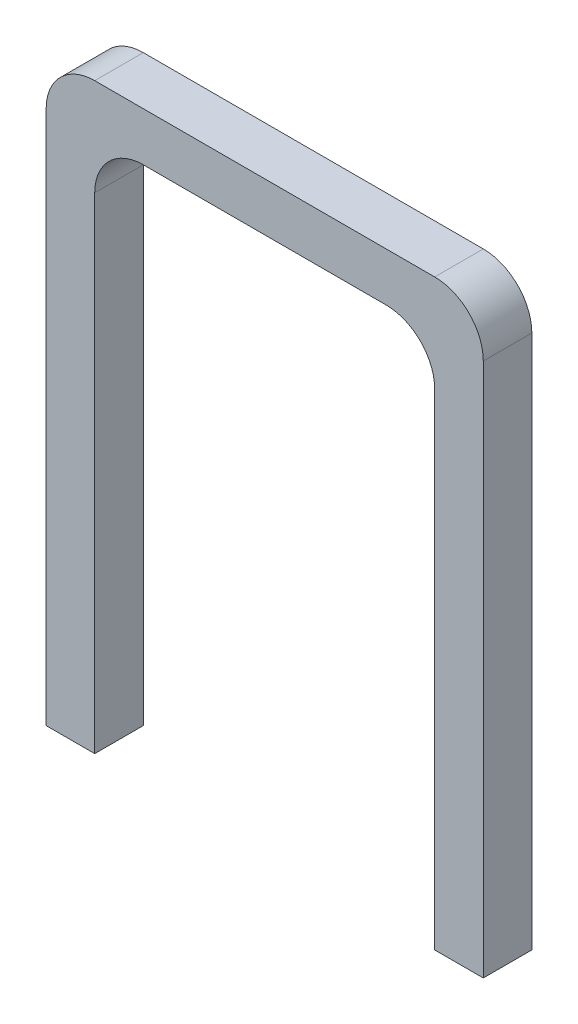
ISO-10303-21;
HEADER;
FILE_DESCRIPTION(('STEP AP214'),'2;1');
FILE_NAME('part.step','',(''),(''),'','','');
FILE_SCHEMA(('AUTOMOTIVE_DESIGN { 1 0 10303 214 1 1 1 1 }'));
ENDSEC;
DATA;
#1=APPLICATION_CONTEXT('core data for automotive mechanical design processes');
#2=APPLICATION_PROTOCOL_DEFINITION('international standard','automotive_design',2000,#1);
#3=PRODUCT_CONTEXT('',#1,'mechanical');
#4=PRODUCT('Part','Part','',(#3));
#5=PRODUCT_RELATED_PRODUCT_CATEGORY('part','',(#4));
#6=PRODUCT_DEFINITION_FORMATION('','',#4);
#7=PRODUCT_DEFINITION_CONTEXT('part definition',#1,'design');
#8=PRODUCT_DEFINITION('design','',#6,#7);
#9=PRODUCT_DEFINITION_SHAPE('','',#8);
#10=(LENGTH_UNIT() NAMED_UNIT(*) SI_UNIT(.MILLI.,.METRE.));
#11=(NAMED_UNIT(*) PLANE_ANGLE_UNIT() SI_UNIT($,.RADIAN.));
#12=(NAMED_UNIT(*) SI_UNIT($,.STERADIAN.) SOLID_ANGLE_UNIT());
#13=UNCERTAINTY_MEASURE_WITH_UNIT(LENGTH_MEASURE(1.E-05),#10,'distance_accuracy_value','');
#14=(GEOMETRIC_REPRESENTATION_CONTEXT(3) GLOBAL_UNCERTAINTY_ASSIGNED_CONTEXT((#13)) GLOBAL_UNIT_ASSIGNED_CONTEXT((#10,
#11,#12)) REPRESENTATION_CONTEXT('',''));
#15=CARTESIAN_POINT('',(0.,0.,0.));
#16=DIRECTION('',(0.,0.,1.));
#17=DIRECTION('',(1.,0.,0.));
#18=AXIS2_PLACEMENT_3D('',#15,#16,#17);
#19=CARTESIAN_POINT('',(18.,22.,0.));
#20=DIRECTION('',(0.,1.,0.));
#21=DIRECTION('',(0.,0.,1.));
#22=AXIS2_PLACEMENT_3D('',#19,#20,#21);
#23=PLANE('',#22);
#24=DIRECTION('',(-1.,0.,0.));
#25=VECTOR('',#24,1.);
#26=CARTESIAN_POINT('',(18.,22.,-2.));
#27=LINE('',#26,#25);
#28=CARTESIAN_POINT('',(14.,22.,-2.));
#29=VERTEX_POINT('',#28);
#30=CARTESIAN_POINT('',(4.,22.,-2.));
#31=VERTEX_POINT('',#30);
#32=EDGE_CURVE('E156',#29,#31,#27,.T.);
#33=ORIENTED_EDGE('',*,*,#32,.F.);
#34=DIRECTION('',(0.,0.,-1.));
#35=VECTOR('',#34,1.);
#36=CARTESIAN_POINT('',(14.,22.,0.));
#37=LINE('',#36,#35);
#38=CARTESIAN_POINT('',(14.,22.,0.));
#39=VERTEX_POINT('',#38);
#40=EDGE_CURVE('E193',#29,#39,#37,.F.);
#41=ORIENTED_EDGE('',*,*,#40,.T.);
#42=DIRECTION('',(-1.,0.,0.));
#43=VECTOR('',#42,1.);
#44=CARTESIAN_POINT('',(18.,22.,0.));
#45=LINE('',#44,#43);
#46=CARTESIAN_POINT('',(4.,22.,0.));
#47=VERTEX_POINT('',#46);
#48=EDGE_CURVE('E159',#39,#47,#45,.T.);
#49=ORIENTED_EDGE('',*,*,#48,.T.);
#50=DIRECTION('',(0.,0.,-1.));
#51=VECTOR('',#50,1.);
#52=CARTESIAN_POINT('',(4.,22.,-2.));
#53=LINE('',#52,#51);
#54=EDGE_CURVE('E190',#47,#31,#53,.T.);
#55=ORIENTED_EDGE('',*,*,#54,.T.);
#56=EDGE_LOOP('',(#33,#41,#49,#55));
#57=FACE_BOUND('',#56,.T.);
#58=ADVANCED_FACE('F33',(#57),#23,.F.);
#59=CARTESIAN_POINT('',(2.,24.,0.));
#60=DIRECTION('',(-1.,0.,0.));
#61=DIRECTION('',(0.,0.,1.));
#62=AXIS2_PLACEMENT_3D('',#59,#60,#61);
#63=PLANE('',#62);
#64=DIRECTION('',(0.,-1.,0.));
#65=VECTOR('',#64,1.);
#66=CARTESIAN_POINT('',(2.,24.,-2.));
#67=LINE('',#66,#65);
#68=CARTESIAN_POINT('',(2.,20.,-2.));
#69=VERTEX_POINT('',#68);
#70=CARTESIAN_POINT('',(2.,0.,-2.));
#71=VERTEX_POINT('',#70);
#72=EDGE_CURVE('E181',#69,#71,#67,.T.);
#73=ORIENTED_EDGE('',*,*,#72,.F.);
#74=DIRECTION('',(0.,0.,-1.));
#75=VECTOR('',#74,1.);
#76=CARTESIAN_POINT('',(2.,20.,0.));
#77=LINE('',#76,#75);
#78=CARTESIAN_POINT('',(2.,20.,0.));
#79=VERTEX_POINT('',#78);
#80=EDGE_CURVE('E195',#69,#79,#77,.F.);
#81=ORIENTED_EDGE('',*,*,#80,.T.);
#82=DIRECTION('',(0.,-1.,0.));
#83=VECTOR('',#82,1.);
#84=CARTESIAN_POINT('',(2.,24.,0.));
#85=LINE('',#84,#83);
#86=CARTESIAN_POINT('',(2.,0.,0.));
#87=VERTEX_POINT('',#86);
#88=EDGE_CURVE('E183',#79,#87,#85,.T.);
#89=ORIENTED_EDGE('',*,*,#88,.T.);
#90=DIRECTION('',(0.,0.,-1.));
#91=VECTOR('',#90,1.);
#92=CARTESIAN_POINT('',(2.,0.,0.));
#93=LINE('',#92,#91);
#94=EDGE_CURVE('E175',#87,#71,#93,.T.);
#95=ORIENTED_EDGE('',*,*,#94,.T.);
#96=EDGE_LOOP('',(#73,#81,#89,#95));
#97=FACE_BOUND('',#96,.T.);
#98=ADVANCED_FACE('F260',(#97),#63,.F.);
#99=CARTESIAN_POINT('',(0.,24.,0.));
#100=DIRECTION('',(1.,0.,0.));
#101=DIRECTION('',(0.,0.,-1.));
#102=AXIS2_PLACEMENT_3D('',#99,#100,#101);
#103=PLANE('',#102);
#104=DIRECTION('',(0.,-1.,0.));
#105=VECTOR('',#104,1.);
#106=CARTESIAN_POINT('',(0.,24.,0.));
#107=LINE('',#106,#105);
#108=CARTESIAN_POINT('',(0.,22.,0.));
#109=VERTEX_POINT('',#108);
#110=CARTESIAN_POINT('',(0.,0.,0.));
#111=VERTEX_POINT('',#110);
#112=EDGE_CURVE('E185',#109,#111,#107,.T.);
#113=ORIENTED_EDGE('',*,*,#112,.F.);
#114=DIRECTION('',(0.,0.,1.));
#115=VECTOR('',#114,1.);
#116=CARTESIAN_POINT('',(0.,22.,0.));
#117=LINE('',#116,#115);
#118=CARTESIAN_POINT('',(0.,22.,-2.));
#119=VERTEX_POINT('',#118);
#120=EDGE_CURVE('E11',#109,#119,#117,.F.);
#121=ORIENTED_EDGE('',*,*,#120,.T.);
#122=DIRECTION('',(0.,-1.,0.));
#123=VECTOR('',#122,1.);
#124=CARTESIAN_POINT('',(0.,24.,-2.));
#125=LINE('',#124,#123);
#126=CARTESIAN_POINT('',(0.,0.,-2.));
#127=VERTEX_POINT('',#126);
#128=EDGE_CURVE('E169',#119,#127,#125,.T.);
#129=ORIENTED_EDGE('',*,*,#128,.T.);
#130=DIRECTION('',(0.,0.,1.));
#131=VECTOR('',#130,1.);
#132=CARTESIAN_POINT('',(0.,0.,0.));
#133=LINE('',#132,#131);
#134=EDGE_CURVE('E162',#127,#111,#133,.T.);
#135=ORIENTED_EDGE('',*,*,#134,.T.);
#136=EDGE_LOOP('',(#113,#121,#129,#135));
#137=FACE_BOUND('',#136,.T.);
#138=ADVANCED_FACE('F226',(#137),#103,.F.);
#139=CARTESIAN_POINT('',(0.,24.,0.));
#140=DIRECTION('',(0.,0.,-1.));
#141=DIRECTION('',(-1.,0.,0.));
#142=AXIS2_PLACEMENT_3D('',#139,#140,#141);
#143=PLANE('',#142);
#144=DIRECTION('',(0.,-1.,0.));
#145=VECTOR('',#144,1.);
#146=CARTESIAN_POINT('',(18.,24.,0.));
#147=LINE('',#146,#145);
#148=CARTESIAN_POINT('',(18.,22.,0.));
#149=VERTEX_POINT('',#148);
#150=CARTESIAN_POINT('',(18.,0.,0.));
#151=VERTEX_POINT('',#150);
#152=EDGE_CURVE('E123',#149,#151,#147,.T.);
#153=ORIENTED_EDGE('',*,*,#152,.F.);
#154=CARTESIAN_POINT('',(16.,22.,0.));
#155=DIRECTION('',(0.,0.,-1.));
#156=DIRECTION('',(-1.,0.,0.));
#157=AXIS2_PLACEMENT_3D('',#154,#155,#156);
#158=CIRCLE('',#157,2.);
#159=CARTESIAN_POINT('',(16.,24.,0.));
#160=VERTEX_POINT('',#159);
#161=EDGE_CURVE('E208',#149,#160,#158,.F.);
#162=ORIENTED_EDGE('',*,*,#161,.T.);
#163=DIRECTION('',(1.,0.,0.));
#164=VECTOR('',#163,1.);
#165=CARTESIAN_POINT('',(0.,24.,0.));
#166=LINE('',#165,#164);
#167=CARTESIAN_POINT('',(2.,24.,0.));
#168=VERTEX_POINT('',#167);
#169=EDGE_CURVE('E163',#168,#160,#166,.T.);
#170=ORIENTED_EDGE('',*,*,#169,.F.);
#171=CARTESIAN_POINT('',(2.,22.,0.));
#172=DIRECTION('',(0.,0.,-1.));
#173=DIRECTION('',(-1.,0.,0.));
#174=AXIS2_PLACEMENT_3D('',#171,#172,#173);
#175=CIRCLE('',#174,2.);
#176=EDGE_CURVE('E206',#168,#109,#175,.F.);
#177=ORIENTED_EDGE('',*,*,#176,.T.);
#178=ORIENTED_EDGE('',*,*,#112,.T.);
#179=DIRECTION('',(1.,0.,0.));
#180=VECTOR('',#179,1.);
#181=CARTESIAN_POINT('',(0.,0.,0.));
#182=LINE('',#181,#180);
#183=EDGE_CURVE('E172',#111,#87,#182,.T.);
#184=ORIENTED_EDGE('',*,*,#183,.T.);
#185=ORIENTED_EDGE('',*,*,#88,.F.);
#186=CARTESIAN_POINT('',(4.,20.,0.));
#187=DIRECTION('',(0.,0.,-1.));
#188=DIRECTION('',(-1.,0.,0.));
#189=AXIS2_PLACEMENT_3D('',#186,#187,#188);
#190=CIRCLE('',#189,2.);
#191=EDGE_CURVE('E203',#79,#47,#190,.T.);
#192=ORIENTED_EDGE('',*,*,#191,.T.);
#193=ORIENTED_EDGE('',*,*,#48,.F.);
#194=CARTESIAN_POINT('',(14.,20.,0.));
#195=DIRECTION('',(0.,0.,-1.));
#196=DIRECTION('',(-1.,0.,0.));
#197=AXIS2_PLACEMENT_3D('',#194,#195,#196);
#198=CIRCLE('',#197,2.);
#199=CARTESIAN_POINT('',(16.,20.,0.));
#200=VERTEX_POINT('',#199);
#201=EDGE_CURVE('E199',#39,#200,#198,.T.);
#202=ORIENTED_EDGE('',*,*,#201,.T.);
#203=DIRECTION('',(0.,1.,0.));
#204=VECTOR('',#203,1.);
#205=CARTESIAN_POINT('',(16.,0.,0.));
#206=LINE('',#205,#204);
#207=CARTESIAN_POINT('',(16.,0.,0.));
#208=VERTEX_POINT('',#207);
#209=EDGE_CURVE('E133',#208,#200,#206,.T.);
#210=ORIENTED_EDGE('',*,*,#209,.F.);
#211=DIRECTION('',(-1.,0.,0.));
#212=VECTOR('',#211,1.);
#213=CARTESIAN_POINT('',(18.,0.,0.));
#214=LINE('',#213,#212);
#215=EDGE_CURVE('E136',#151,#208,#214,.T.);
#216=ORIENTED_EDGE('',*,*,#215,.F.);
#217=EDGE_LOOP('',(#153,#162,#170,#177,#178,#184,#185,#192,#193,#202,#210,#216));
#218=FACE_BOUND('',#217,.T.);
#219=ADVANCED_FACE('F137',(#218),#143,.F.);
#220=CARTESIAN_POINT('',(0.,24.,-2.));
#221=DIRECTION('',(0.,0.,1.));
#222=DIRECTION('',(1.,0.,0.));
#223=AXIS2_PLACEMENT_3D('',#220,#221,#222);
#224=PLANE('',#223);
#225=DIRECTION('',(-1.,0.,0.));
#226=VECTOR('',#225,1.);
#227=CARTESIAN_POINT('',(0.,24.,-2.));
#228=LINE('',#227,#226);
#229=CARTESIAN_POINT('',(16.,24.,-2.));
#230=VERTEX_POINT('',#229);
#231=CARTESIAN_POINT('',(2.,24.,-2.));
#232=VERTEX_POINT('',#231);
#233=EDGE_CURVE('E166',#230,#232,#228,.T.);
#234=ORIENTED_EDGE('',*,*,#233,.F.);
#235=CARTESIAN_POINT('',(16.,22.,-2.));
#236=DIRECTION('',(0.,0.,1.));
#237=DIRECTION('',(1.,0.,0.));
#238=AXIS2_PLACEMENT_3D('',#235,#236,#237);
#239=CIRCLE('',#238,2.);
#240=CARTESIAN_POINT('',(18.,22.,-2.));
#241=VERTEX_POINT('',#240);
#242=EDGE_CURVE('E41',#230,#241,#239,.F.);
#243=ORIENTED_EDGE('',*,*,#242,.T.);
#244=DIRECTION('',(0.,1.,0.));
#245=VECTOR('',#244,1.);
#246=CARTESIAN_POINT('',(18.,24.,-2.));
#247=LINE('',#246,#245);
#248=CARTESIAN_POINT('',(18.,0.,-2.));
#249=VERTEX_POINT('',#248);
#250=EDGE_CURVE('E132',#249,#241,#247,.T.);
#251=ORIENTED_EDGE('',*,*,#250,.F.);
#252=DIRECTION('',(1.,0.,0.));
#253=VECTOR('',#252,1.);
#254=CARTESIAN_POINT('',(18.,0.,-2.));
#255=LINE('',#254,#253);
#256=CARTESIAN_POINT('',(16.,0.,-2.));
#257=VERTEX_POINT('',#256);
#258=EDGE_CURVE('E146',#257,#249,#255,.T.);
#259=ORIENTED_EDGE('',*,*,#258,.F.);
#260=DIRECTION('',(0.,1.,0.));
#261=VECTOR('',#260,1.);
#262=CARTESIAN_POINT('',(16.,0.,-2.));
#263=LINE('',#262,#261);
#264=CARTESIAN_POINT('',(16.,20.,-2.));
#265=VERTEX_POINT('',#264);
#266=EDGE_CURVE('E151',#257,#265,#263,.T.);
#267=ORIENTED_EDGE('',*,*,#266,.T.);
#268=CARTESIAN_POINT('',(14.,20.,-2.));
#269=DIRECTION('',(0.,0.,1.));
#270=DIRECTION('',(1.,0.,0.));
#271=AXIS2_PLACEMENT_3D('',#268,#269,#270);
#272=CIRCLE('',#271,2.);
#273=EDGE_CURVE('E197',#265,#29,#272,.T.);
#274=ORIENTED_EDGE('',*,*,#273,.T.);
#275=ORIENTED_EDGE('',*,*,#32,.T.);
#276=CARTESIAN_POINT('',(4.,20.,-2.));
#277=DIRECTION('',(0.,0.,1.));
#278=DIRECTION('',(1.,0.,0.));
#279=AXIS2_PLACEMENT_3D('',#276,#277,#278);
#280=CIRCLE('',#279,2.);
#281=EDGE_CURVE('E201',#31,#69,#280,.T.);
#282=ORIENTED_EDGE('',*,*,#281,.T.);
#283=ORIENTED_EDGE('',*,*,#72,.T.);
#284=DIRECTION('',(-1.,0.,0.));
#285=VECTOR('',#284,1.);
#286=CARTESIAN_POINT('',(0.,0.,-2.));
#287=LINE('',#286,#285);
#288=EDGE_CURVE('E167',#71,#127,#287,.T.);
#289=ORIENTED_EDGE('',*,*,#288,.T.);
#290=ORIENTED_EDGE('',*,*,#128,.F.);
#291=CARTESIAN_POINT('',(2.,22.,-2.));
#292=DIRECTION('',(0.,0.,1.));
#293=DIRECTION('',(1.,0.,0.));
#294=AXIS2_PLACEMENT_3D('',#291,#292,#293);
#295=CIRCLE('',#294,2.);
#296=EDGE_CURVE('E53',#119,#232,#295,.F.);
#297=ORIENTED_EDGE('',*,*,#296,.T.);
#298=EDGE_LOOP('',(#234,#243,#251,#259,#267,#274,#275,#282,#283,#289,#290,#297));
#299=FACE_BOUND('',#298,.T.);
#300=ADVANCED_FACE('F216',(#299),#224,.F.);
#301=CARTESIAN_POINT('',(0.,24.,0.));
#302=DIRECTION('',(0.,-1.,0.));
#303=DIRECTION('',(0.,0.,-1.));
#304=AXIS2_PLACEMENT_3D('',#301,#302,#303);
#305=PLANE('',#304);
#306=ORIENTED_EDGE('',*,*,#169,.T.);
#307=DIRECTION('',(0.,0.,1.));
#308=VECTOR('',#307,1.);
#309=CARTESIAN_POINT('',(16.,24.,-2.));
#310=LINE('',#309,#308);
#311=EDGE_CURVE('E213',#160,#230,#310,.F.);
#312=ORIENTED_EDGE('',*,*,#311,.T.);
#313=ORIENTED_EDGE('',*,*,#233,.T.);
#314=DIRECTION('',(0.,0.,1.));
#315=VECTOR('',#314,1.);
#316=CARTESIAN_POINT('',(2.,24.,0.));
#317=LINE('',#316,#315);
#318=EDGE_CURVE('E210',#232,#168,#317,.T.);
#319=ORIENTED_EDGE('',*,*,#318,.T.);
#320=EDGE_LOOP('',(#306,#312,#313,#319));
#321=FACE_BOUND('',#320,.T.);
#322=ADVANCED_FACE('F222',(#321),#305,.F.);
#323=CARTESIAN_POINT('',(0.,0.,0.));
#324=DIRECTION('',(0.,-1.,0.));
#325=DIRECTION('',(0.,0.,-1.));
#326=AXIS2_PLACEMENT_3D('',#323,#324,#325);
#327=PLANE('',#326);
#328=ORIENTED_EDGE('',*,*,#134,.F.);
#329=ORIENTED_EDGE('',*,*,#288,.F.);
#330=ORIENTED_EDGE('',*,*,#94,.F.);
#331=ORIENTED_EDGE('',*,*,#183,.F.);
#332=EDGE_LOOP('',(#328,#329,#330,#331));
#333=FACE_BOUND('',#332,.T.);
#334=ADVANCED_FACE('F230',(#333),#327,.T.);
#335=CARTESIAN_POINT('',(18.,0.,0.));
#336=DIRECTION('',(1.,0.,0.));
#337=DIRECTION('',(0.,0.,-1.));
#338=AXIS2_PLACEMENT_3D('',#335,#336,#337);
#339=PLANE('',#338);
#340=ORIENTED_EDGE('',*,*,#250,.T.);
#341=DIRECTION('',(0.,0.,1.));
#342=VECTOR('',#341,1.);
#343=CARTESIAN_POINT('',(18.,22.,0.));
#344=LINE('',#343,#342);
#345=EDGE_CURVE('E130',#241,#149,#344,.T.);
#346=ORIENTED_EDGE('',*,*,#345,.T.);
#347=ORIENTED_EDGE('',*,*,#152,.T.);
#348=DIRECTION('',(0.,0.,1.));
#349=VECTOR('',#348,1.);
#350=CARTESIAN_POINT('',(18.,0.,0.));
#351=LINE('',#350,#349);
#352=EDGE_CURVE('E128',#249,#151,#351,.T.);
#353=ORIENTED_EDGE('',*,*,#352,.F.);
#354=EDGE_LOOP('',(#340,#346,#347,#353));
#355=FACE_BOUND('',#354,.T.);
#356=ADVANCED_FACE('F126',(#355),#339,.T.);
#357=CARTESIAN_POINT('',(16.,0.,0.));
#358=DIRECTION('',(1.,0.,0.));
#359=DIRECTION('',(0.,0.,-1.));
#360=AXIS2_PLACEMENT_3D('',#357,#358,#359);
#361=PLANE('',#360);
#362=ORIENTED_EDGE('',*,*,#209,.T.);
#363=DIRECTION('',(0.,0.,-1.));
#364=VECTOR('',#363,1.);
#365=CARTESIAN_POINT('',(16.,20.,-2.));
#366=LINE('',#365,#364);
#367=EDGE_CURVE('E187',#200,#265,#366,.T.);
#368=ORIENTED_EDGE('',*,*,#367,.T.);
#369=ORIENTED_EDGE('',*,*,#266,.F.);
#370=DIRECTION('',(0.,0.,-1.));
#371=VECTOR('',#370,1.);
#372=CARTESIAN_POINT('',(16.,0.,0.));
#373=LINE('',#372,#371);
#374=EDGE_CURVE('E141',#208,#257,#373,.T.);
#375=ORIENTED_EDGE('',*,*,#374,.F.);
#376=EDGE_LOOP('',(#362,#368,#369,#375));
#377=FACE_BOUND('',#376,.T.);
#378=ADVANCED_FACE('F250',(#377),#361,.F.);
#379=CARTESIAN_POINT('',(0.,0.,0.));
#380=DIRECTION('',(0.,1.,0.));
#381=DIRECTION('',(0.,0.,1.));
#382=AXIS2_PLACEMENT_3D('',#379,#380,#381);
#383=PLANE('',#382);
#384=ORIENTED_EDGE('',*,*,#352,.T.);
#385=ORIENTED_EDGE('',*,*,#215,.T.);
#386=ORIENTED_EDGE('',*,*,#374,.T.);
#387=ORIENTED_EDGE('',*,*,#258,.T.);
#388=EDGE_LOOP('',(#384,#385,#386,#387));
#389=FACE_BOUND('',#388,.T.);
#390=ADVANCED_FACE('F144',(#389),#383,.F.);
#391=CARTESIAN_POINT('',(14.,20.,0.));
#392=DIRECTION('',(0.,0.,1.));
#393=DIRECTION('',(1.,0.,0.));
#394=AXIS2_PLACEMENT_3D('',#391,#392,#393);
#395=CYLINDRICAL_SURFACE('',#394,2.);
#396=ORIENTED_EDGE('',*,*,#201,.F.);
#397=ORIENTED_EDGE('',*,*,#40,.F.);
#398=ORIENTED_EDGE('',*,*,#273,.F.);
#399=ORIENTED_EDGE('',*,*,#367,.F.);
#400=EDGE_LOOP('',(#396,#397,#398,#399));
#401=FACE_BOUND('',#400,.T.);
#402=ADVANCED_FACE('F248',(#401),#395,.F.);
#403=CARTESIAN_POINT('',(4.,20.,0.));
#404=DIRECTION('',(0.,0.,1.));
#405=DIRECTION('',(1.,0.,0.));
#406=AXIS2_PLACEMENT_3D('',#403,#404,#405);
#407=CYLINDRICAL_SURFACE('',#406,2.);
#408=ORIENTED_EDGE('',*,*,#191,.F.);
#409=ORIENTED_EDGE('',*,*,#80,.F.);
#410=ORIENTED_EDGE('',*,*,#281,.F.);
#411=ORIENTED_EDGE('',*,*,#54,.F.);
#412=EDGE_LOOP('',(#408,#409,#410,#411));
#413=FACE_BOUND('',#412,.T.);
#414=ADVANCED_FACE('F239',(#413),#407,.F.);
#415=CARTESIAN_POINT('',(16.,22.,0.));
#416=DIRECTION('',(0.,0.,-1.));
#417=DIRECTION('',(-1.,0.,0.));
#418=AXIS2_PLACEMENT_3D('',#415,#416,#417);
#419=CYLINDRICAL_SURFACE('',#418,2.);
#420=ORIENTED_EDGE('',*,*,#242,.F.);
#421=ORIENTED_EDGE('',*,*,#311,.F.);
#422=ORIENTED_EDGE('',*,*,#161,.F.);
#423=ORIENTED_EDGE('',*,*,#345,.F.);
#424=EDGE_LOOP('',(#420,#421,#422,#423));
#425=FACE_BOUND('',#424,.T.);
#426=ADVANCED_FACE('F219',(#425),#419,.T.);
#427=CARTESIAN_POINT('',(2.,22.,0.));
#428=DIRECTION('',(0.,0.,1.));
#429=DIRECTION('',(1.,0.,0.));
#430=AXIS2_PLACEMENT_3D('',#427,#428,#429);
#431=CYLINDRICAL_SURFACE('',#430,2.);
#432=ORIENTED_EDGE('',*,*,#296,.F.);
#433=ORIENTED_EDGE('',*,*,#120,.F.);
#434=ORIENTED_EDGE('',*,*,#176,.F.);
#435=ORIENTED_EDGE('',*,*,#318,.F.);
#436=EDGE_LOOP('',(#432,#433,#434,#435));
#437=FACE_BOUND('',#436,.T.);
#438=ADVANCED_FACE('F35',(#437),#431,.T.);
#439=CLOSED_SHELL('',(#58,#98,#138,#219,#300,#322,#334,#356,#378,#390,#402,#414,#426,#438));
#440=MANIFOLD_SOLID_BREP('B2',#439);
#441=ADVANCED_BREP_SHAPE_REPRESENTATION('',(#18,#440),#14);
#442=SHAPE_DEFINITION_REPRESENTATION(#9,#441);
ENDSEC;
END-ISO-10303-21;
